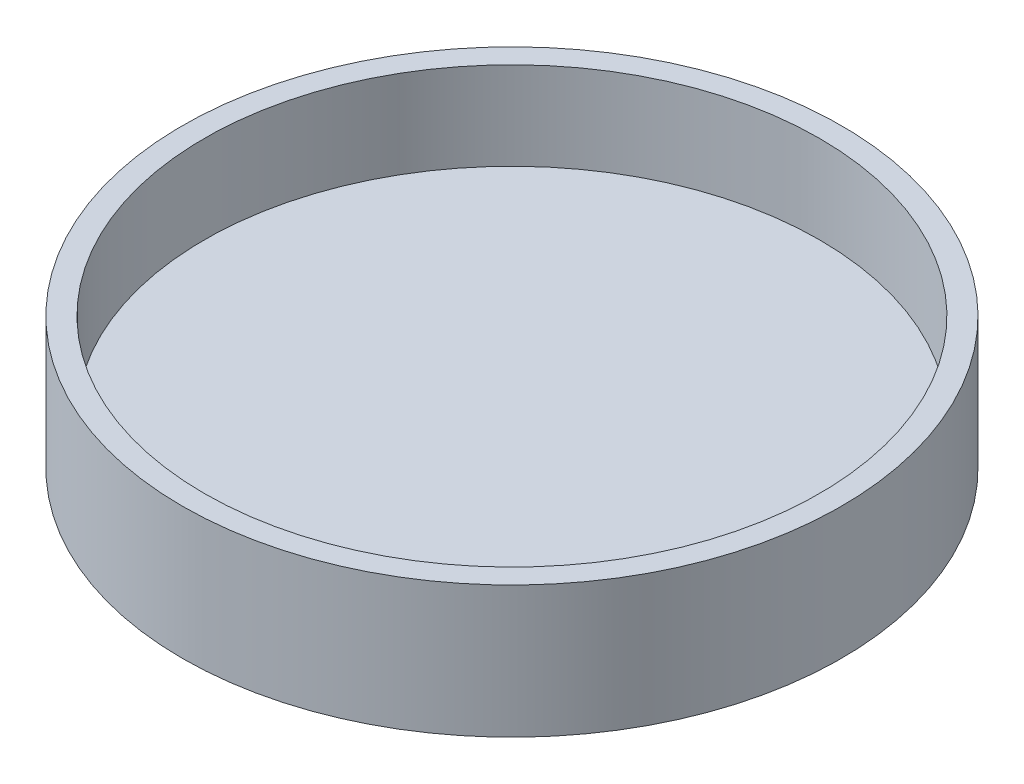
ISO-10303-21;
HEADER;
FILE_DESCRIPTION(('STEP AP214'),'2;1');
FILE_NAME('part.step','',(''),(''),'','','');
FILE_SCHEMA(('AUTOMOTIVE_DESIGN { 1 0 10303 214 1 1 1 1 }'));
ENDSEC;
DATA;
#1=APPLICATION_CONTEXT('core data for automotive mechanical design processes');
#2=APPLICATION_PROTOCOL_DEFINITION('international standard','automotive_design',2000,#1);
#3=PRODUCT_CONTEXT('',#1,'mechanical');
#4=PRODUCT('Part','Part','',(#3));
#5=PRODUCT_RELATED_PRODUCT_CATEGORY('part','',(#4));
#6=PRODUCT_DEFINITION_FORMATION('','',#4);
#7=PRODUCT_DEFINITION_CONTEXT('part definition',#1,'design');
#8=PRODUCT_DEFINITION('design','',#6,#7);
#9=PRODUCT_DEFINITION_SHAPE('','',#8);
#10=(LENGTH_UNIT() NAMED_UNIT(*) SI_UNIT(.MILLI.,.METRE.));
#11=(NAMED_UNIT(*) PLANE_ANGLE_UNIT() SI_UNIT($,.RADIAN.));
#12=(NAMED_UNIT(*) SI_UNIT($,.STERADIAN.) SOLID_ANGLE_UNIT());
#13=UNCERTAINTY_MEASURE_WITH_UNIT(LENGTH_MEASURE(1.E-05),#10,'distance_accuracy_value','');
#14=(GEOMETRIC_REPRESENTATION_CONTEXT(3) GLOBAL_UNCERTAINTY_ASSIGNED_CONTEXT((#13)) GLOBAL_UNIT_ASSIGNED_CONTEXT((#10,
#11,#12)) REPRESENTATION_CONTEXT('',''));
#15=CARTESIAN_POINT('',(0.,0.,0.));
#16=DIRECTION('',(0.,0.,1.));
#17=DIRECTION('',(1.,0.,0.));
#18=AXIS2_PLACEMENT_3D('',#15,#16,#17);
#19=CARTESIAN_POINT('',(0.,25.4,0.));
#20=DIRECTION('',(0.,-1.,0.));
#21=DIRECTION('',(0.,0.,-1.));
#22=AXIS2_PLACEMENT_3D('',#19,#20,#21);
#23=CYLINDRICAL_SURFACE('',#22,190.5);
#24=CARTESIAN_POINT('',(0.,0.,0.));
#25=DIRECTION('',(0.,1.,0.));
#26=DIRECTION('',(0.,0.,1.));
#27=AXIS2_PLACEMENT_3D('',#24,#25,#26);
#28=CIRCLE('',#27,190.5);
#29=CARTESIAN_POINT('',(0.,0.,190.5));
#30=VERTEX_POINT('',#29);
#31=EDGE_CURVE('E41',#30,#30,#28,.T.);
#32=ORIENTED_EDGE('',*,*,#31,.T.);
#33=EDGE_LOOP('',(#32));
#34=FACE_BOUND('',#33,.T.);
#35=CARTESIAN_POINT('',(0.,76.2,0.));
#36=DIRECTION('',(0.,1.,0.));
#37=DIRECTION('',(0.,0.,1.));
#38=AXIS2_PLACEMENT_3D('',#35,#36,#37);
#39=CIRCLE('',#38,190.5);
#40=CARTESIAN_POINT('',(0.,76.2,190.5));
#41=VERTEX_POINT('',#40);
#42=EDGE_CURVE('E45',#41,#41,#39,.T.);
#43=ORIENTED_EDGE('',*,*,#42,.F.);
#44=EDGE_LOOP('',(#43));
#45=FACE_BOUND('',#44,.T.);
#46=ADVANCED_FACE('F35',(#34,#45),#23,.T.);
#47=CARTESIAN_POINT('',(0.,0.,0.));
#48=DIRECTION('',(0.,1.,0.));
#49=DIRECTION('',(0.,0.,1.));
#50=AXIS2_PLACEMENT_3D('',#47,#48,#49);
#51=PLANE('',#50);
#52=ORIENTED_EDGE('',*,*,#31,.F.);
#53=EDGE_LOOP('',(#52));
#54=FACE_BOUND('',#53,.T.);
#55=ADVANCED_FACE('F59',(#54),#51,.F.);
#56=CARTESIAN_POINT('',(0.,76.2,0.));
#57=DIRECTION('',(0.,1.,0.));
#58=DIRECTION('',(0.,0.,1.));
#59=AXIS2_PLACEMENT_3D('',#56,#57,#58);
#60=PLANE('',#59);
#61=ORIENTED_EDGE('',*,*,#42,.T.);
#62=EDGE_LOOP('',(#61));
#63=FACE_BOUND('',#62,.T.);
#64=CARTESIAN_POINT('',(0.,76.2,0.));
#65=DIRECTION('',(0.,1.,0.));
#66=DIRECTION('',(0.,0.,1.));
#67=AXIS2_PLACEMENT_3D('',#64,#65,#66);
#68=CIRCLE('',#67,177.8);
#69=CARTESIAN_POINT('',(0.,76.2,177.8));
#70=VERTEX_POINT('',#69);
#71=EDGE_CURVE('E49',#70,#70,#68,.T.);
#72=ORIENTED_EDGE('',*,*,#71,.F.);
#73=EDGE_LOOP('',(#72));
#74=FACE_BOUND('',#73,.T.);
#75=ADVANCED_FACE('F57',(#63,#74),#60,.T.);
#76=CARTESIAN_POINT('',(0.,76.2,0.));
#77=DIRECTION('',(0.,-1.,0.));
#78=DIRECTION('',(0.,0.,-1.));
#79=AXIS2_PLACEMENT_3D('',#76,#77,#78);
#80=CYLINDRICAL_SURFACE('',#79,177.8);
#81=ORIENTED_EDGE('',*,*,#71,.T.);
#82=EDGE_LOOP('',(#81));
#83=FACE_BOUND('',#82,.T.);
#84=CARTESIAN_POINT('',(0.,25.4,0.));
#85=DIRECTION('',(0.,1.,0.));
#86=DIRECTION('',(0.,0.,1.));
#87=AXIS2_PLACEMENT_3D('',#84,#85,#86);
#88=CIRCLE('',#87,177.8);
#89=CARTESIAN_POINT('',(0.,25.4,177.8));
#90=VERTEX_POINT('',#89);
#91=EDGE_CURVE('E10',#90,#90,#88,.F.);
#92=ORIENTED_EDGE('',*,*,#91,.T.);
#93=EDGE_LOOP('',(#92));
#94=FACE_BOUND('',#93,.T.);
#95=ADVANCED_FACE('F55',(#83,#94),#80,.F.);
#96=CARTESIAN_POINT('',(0.,25.4,0.));
#97=DIRECTION('',(0.,1.,0.));
#98=DIRECTION('',(0.,0.,1.));
#99=AXIS2_PLACEMENT_3D('',#96,#97,#98);
#100=PLANE('',#99);
#101=ORIENTED_EDGE('',*,*,#91,.F.);
#102=EDGE_LOOP('',(#101));
#103=FACE_BOUND('',#102,.T.);
#104=ADVANCED_FACE('F66',(#103),#100,.T.);
#105=CLOSED_SHELL('',(#46,#55,#75,#95,#104));
#106=MANIFOLD_SOLID_BREP('B2',#105);
#107=ADVANCED_BREP_SHAPE_REPRESENTATION('',(#18,#106),#14);
#108=SHAPE_DEFINITION_REPRESENTATION(#9,#107);
ENDSEC;
END-ISO-10303-21;
